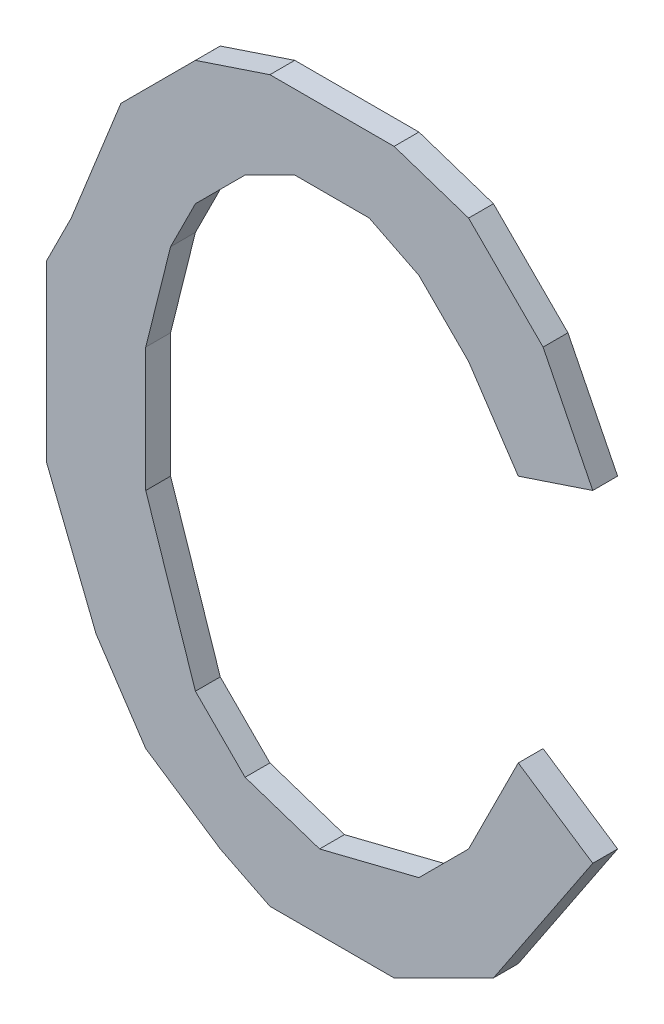
ISO-10303-21;
HEADER;
FILE_DESCRIPTION(('STEP AP214'),'2;1');
FILE_NAME('part.step','',(''),(''),'','','');
FILE_SCHEMA(('AUTOMOTIVE_DESIGN { 1 0 10303 214 1 1 1 1 }'));
ENDSEC;
DATA;
#1=APPLICATION_CONTEXT('core data for automotive mechanical design processes');
#2=APPLICATION_PROTOCOL_DEFINITION('international standard','automotive_design',2000,#1);
#3=PRODUCT_CONTEXT('',#1,'mechanical');
#4=PRODUCT('Part','Part','',(#3));
#5=PRODUCT_RELATED_PRODUCT_CATEGORY('part','',(#4));
#6=PRODUCT_DEFINITION_FORMATION('','',#4);
#7=PRODUCT_DEFINITION_CONTEXT('part definition',#1,'design');
#8=PRODUCT_DEFINITION('design','',#6,#7);
#9=PRODUCT_DEFINITION_SHAPE('','',#8);
#10=(LENGTH_UNIT() NAMED_UNIT(*) SI_UNIT(.MILLI.,.METRE.));
#11=(NAMED_UNIT(*) PLANE_ANGLE_UNIT() SI_UNIT($,.RADIAN.));
#12=(NAMED_UNIT(*) SI_UNIT($,.STERADIAN.) SOLID_ANGLE_UNIT());
#13=UNCERTAINTY_MEASURE_WITH_UNIT(LENGTH_MEASURE(1.E-05),#10,'distance_accuracy_value','');
#14=(GEOMETRIC_REPRESENTATION_CONTEXT(3) GLOBAL_UNCERTAINTY_ASSIGNED_CONTEXT((#13)) GLOBAL_UNIT_ASSIGNED_CONTEXT((#10,
#11,#12)) REPRESENTATION_CONTEXT('',''));
#15=CARTESIAN_POINT('',(0.,0.,0.));
#16=DIRECTION('',(0.,0.,1.));
#17=DIRECTION('',(1.,0.,0.));
#18=AXIS2_PLACEMENT_3D('',#15,#16,#17);
#19=CARTESIAN_POINT('',(-0.06999732,0.02500122000001,0.));
#20=DIRECTION('',(0.,0.,1.));
#21=DIRECTION('',(1.,0.,0.));
#22=AXIS2_PLACEMENT_3D('',#19,#20,#21);
#23=PLANE('',#22);
#24=DIRECTION('',(0.316227766016838,-0.948683298050514,0.));
#25=VECTOR('',#24,1.);
#26=CARTESIAN_POINT('',(-0.04999736000001,-0.08499855999999,0.));
#27=LINE('',#26,#25);
#28=CARTESIAN_POINT('',(-0.069997320000003,-0.024998680000001,0.));
#29=VERTEX_POINT('',#28);
#30=CARTESIAN_POINT('',(-0.04999736000001,-0.08499855999999,0.));
#31=VERTEX_POINT('',#30);
#32=EDGE_CURVE('E395',#29,#31,#27,.T.);
#33=ORIENTED_EDGE('',*,*,#32,.T.);
#34=DIRECTION('',(0.707106781186548,-0.707106781186548,0.));
#35=VECTOR('',#34,1.);
#36=CARTESIAN_POINT('',(-0.0299974,-0.10499852,0.));
#37=LINE('',#36,#35);
#38=CARTESIAN_POINT('',(-0.0299973999999986,-0.104998519999996,0.));
#39=VERTEX_POINT('',#38);
#40=EDGE_CURVE('E390',#31,#39,#37,.T.);
#41=ORIENTED_EDGE('',*,*,#40,.T.);
#42=DIRECTION('',(0.948683298050414,-0.316227766017138,0.));
#43=VECTOR('',#42,1.);
#44=CARTESIAN_POINT('',(2.539999996998E-06,-0.1149985,0.));
#45=LINE('',#44,#43);
#46=CARTESIAN_POINT('',(2.53999999587647E-06,-0.114998499999996,0.));
#47=VERTEX_POINT('',#46);
#48=EDGE_CURVE('E385',#39,#47,#45,.T.);
#49=ORIENTED_EDGE('',*,*,#48,.T.);
#50=DIRECTION('',(0.970142500145391,0.242535625036098,0.));
#51=VECTOR('',#50,1.);
#52=CARTESIAN_POINT('',(0.04000246,-0.10499852,0.));
#53=LINE('',#52,#51);
#54=CARTESIAN_POINT('',(0.0400024600000021,-0.104998520000002,0.));
#55=VERTEX_POINT('',#54);
#56=EDGE_CURVE('E380',#47,#55,#53,.T.);
#57=ORIENTED_EDGE('',*,*,#56,.T.);
#58=DIRECTION('',(0.707106781186048,0.707106781187048,0.));
#59=VECTOR('',#58,1.);
#60=CARTESIAN_POINT('',(0.06000241999999,-0.08499855999999,0.));
#61=LINE('',#60,#59);
#62=CARTESIAN_POINT('',(0.060002419999994,-0.084998559999992,0.));
#63=VERTEX_POINT('',#62);
#64=EDGE_CURVE('E375',#55,#63,#61,.T.);
#65=ORIENTED_EDGE('',*,*,#64,.T.);
#66=DIRECTION('',(0.447213595499958,0.894427190999916,0.));
#67=VECTOR('',#66,1.);
#68=CARTESIAN_POINT('',(0.08000238,-0.04499863999999,0.));
#69=LINE('',#68,#67);
#70=CARTESIAN_POINT('',(0.0800023799999949,-0.0449986399999976,0.));
#71=VERTEX_POINT('',#70);
#72=EDGE_CURVE('E370',#63,#71,#69,.T.);
#73=ORIENTED_EDGE('',*,*,#72,.T.);
#74=DIRECTION('',(0.832050294337997,-0.554700196224998,0.));
#75=VECTOR('',#74,1.);
#76=CARTESIAN_POINT('',(0.11000232,-0.0649986,0.));
#77=LINE('',#76,#75);
#78=CARTESIAN_POINT('',(0.110002319999988,-0.0649985999999921,0.));
#79=VERTEX_POINT('',#78);
#80=EDGE_CURVE('E365',#71,#79,#77,.T.);
#81=ORIENTED_EDGE('',*,*,#80,.T.);
#82=DIRECTION('',(-0.554700196224998,-0.832050294337997,0.));
#83=VECTOR('',#82,1.);
#84=CARTESIAN_POINT('',(0.07000239999999,-0.12499848,0.));
#85=LINE('',#84,#83);
#86=CARTESIAN_POINT('',(0.07000239999999,-0.12499848,0.));
#87=VERTEX_POINT('',#86);
#88=EDGE_CURVE('E360',#79,#87,#85,.T.);
#89=ORIENTED_EDGE('',*,*,#88,.T.);
#90=DIRECTION('',(-0.894427190999916,-0.447213595499958,0.));
#91=VECTOR('',#90,1.);
#92=CARTESIAN_POINT('',(0.03000247999999,-0.14499844,0.));
#93=LINE('',#92,#91);
#94=CARTESIAN_POINT('',(0.03000247999999,-0.14499844,0.));
#95=VERTEX_POINT('',#94);
#96=EDGE_CURVE('E355',#87,#95,#93,.T.);
#97=ORIENTED_EDGE('',*,*,#96,.T.);
#98=DIRECTION('',(1.,0.,0.));
#99=VECTOR('',#98,1.);
#100=CARTESIAN_POINT('',(-0.01999742000001,-0.14499844,0.));
#101=LINE('',#100,#99);
#102=CARTESIAN_POINT('',(-0.019997420000009,-0.144998439999998,0.));
#103=VERTEX_POINT('',#102);
#104=EDGE_CURVE('E350',#95,#103,#101,.F.);
#105=ORIENTED_EDGE('',*,*,#104,.T.);
#106=DIRECTION('',(-0.894427190999916,0.447213595499958,0.));
#107=VECTOR('',#106,1.);
#108=CARTESIAN_POINT('',(-0.03999738,-0.13499846,0.));
#109=LINE('',#108,#107);
#110=CARTESIAN_POINT('',(-0.0399973799999972,-0.134998459999996,0.));
#111=VERTEX_POINT('',#110);
#112=EDGE_CURVE('E345',#103,#111,#109,.T.);
#113=ORIENTED_EDGE('',*,*,#112,.T.);
#114=DIRECTION('',(-0.832050294337997,0.554700196224998,0.));
#115=VECTOR('',#114,1.);
#116=CARTESIAN_POINT('',(-0.06999732,-0.1149985,0.));
#117=LINE('',#116,#115);
#118=CARTESIAN_POINT('',(-0.0699973200000011,-0.114998500000001,0.));
#119=VERTEX_POINT('',#118);
#120=EDGE_CURVE('E340',#111,#119,#117,.T.);
#121=ORIENTED_EDGE('',*,*,#120,.T.);
#122=DIRECTION('',(-0.554748964411929,0.832017780148893,0.));
#123=VECTOR('',#122,1.);
#124=CARTESIAN_POINT('',(-0.08999982,-0.08499855999999,0.));
#125=LINE('',#124,#123);
#126=CARTESIAN_POINT('',(-0.0899998200000017,-0.0849985599999907,0.));
#127=VERTEX_POINT('',#126);
#128=EDGE_CURVE('E335',#119,#127,#125,.T.);
#129=ORIENTED_EDGE('',*,*,#128,.T.);
#130=DIRECTION('',(-0.371390676354104,0.928476690885259,0.));
#131=VECTOR('',#130,1.);
#132=CARTESIAN_POINT('',(-0.10999978,-0.03499866,0.));
#133=LINE('',#132,#131);
#134=CARTESIAN_POINT('',(-0.10999978,-0.03499866,0.));
#135=VERTEX_POINT('',#134);
#136=EDGE_CURVE('E330',#127,#135,#133,.T.);
#137=ORIENTED_EDGE('',*,*,#136,.T.);
#138=DIRECTION('',(0.,1.,0.));
#139=VECTOR('',#138,1.);
#140=CARTESIAN_POINT('',(-0.10999978,0.03500120000001,0.));
#141=LINE('',#140,#139);
#142=CARTESIAN_POINT('',(-0.109999780000002,0.035001200000011,0.));
#143=VERTEX_POINT('',#142);
#144=EDGE_CURVE('E325',#135,#143,#141,.T.);
#145=ORIENTED_EDGE('',*,*,#144,.T.);
#146=DIRECTION('',(0.447213595499958,0.894427190999916,0.));
#147=VECTOR('',#146,1.);
#148=CARTESIAN_POINT('',(-0.09999980000001,0.05500116,0.));
#149=LINE('',#148,#147);
#150=CARTESIAN_POINT('',(-0.0999998000000056,0.0550011599999985,0.));
#151=VERTEX_POINT('',#150);
#152=EDGE_CURVE('E320',#143,#151,#149,.T.);
#153=ORIENTED_EDGE('',*,*,#152,.T.);
#154=DIRECTION('',(0.371390676354104,0.928476690885259,0.));
#155=VECTOR('',#154,1.);
#156=CARTESIAN_POINT('',(-0.07999984,0.10500106,0.));
#157=LINE('',#156,#155);
#158=CARTESIAN_POINT('',(-0.0799998400000079,0.105001060000008,0.));
#159=VERTEX_POINT('',#158);
#160=EDGE_CURVE('E315',#151,#159,#157,.T.);
#161=ORIENTED_EDGE('',*,*,#160,.T.);
#162=DIRECTION('',(0.707136713532992,0.707076847572992,0.));
#163=VECTOR('',#162,1.);
#164=CARTESIAN_POINT('',(-0.04999736000001,0.135001,0.));
#165=LINE('',#164,#163);
#166=CARTESIAN_POINT('',(-0.0499973600000084,0.135000999999995,0.));
#167=VERTEX_POINT('',#166);
#168=EDGE_CURVE('E310',#159,#167,#165,.T.);
#169=ORIENTED_EDGE('',*,*,#168,.T.);
#170=DIRECTION('',(0.948683298050414,0.316227766017138,0.));
#171=VECTOR('',#170,1.);
#172=CARTESIAN_POINT('',(-0.01999742000001,0.14500098,0.));
#173=LINE('',#172,#171);
#174=CARTESIAN_POINT('',(-0.01999742000001,0.14500098,0.));
#175=VERTEX_POINT('',#174);
#176=EDGE_CURVE('E305',#167,#175,#173,.T.);
#177=ORIENTED_EDGE('',*,*,#176,.T.);
#178=DIRECTION('',(1.,0.,0.));
#179=VECTOR('',#178,1.);
#180=CARTESIAN_POINT('',(0.03000247999999,0.14500098,0.));
#181=LINE('',#180,#179);
#182=CARTESIAN_POINT('',(0.0300024799999916,0.145000980000005,0.));
#183=VERTEX_POINT('',#182);
#184=EDGE_CURVE('E300',#175,#183,#181,.T.);
#185=ORIENTED_EDGE('',*,*,#184,.T.);
#186=DIRECTION('',(0.948683298050414,-0.316227766017138,0.));
#187=VECTOR('',#186,1.);
#188=CARTESIAN_POINT('',(0.06000241999999,0.135001,0.));
#189=LINE('',#188,#187);
#190=CARTESIAN_POINT('',(0.0600024199999819,0.135000999999992,0.));
#191=VERTEX_POINT('',#190);
#192=EDGE_CURVE('E295',#183,#191,#189,.T.);
#193=ORIENTED_EDGE('',*,*,#192,.T.);
#194=DIRECTION('',(0.707106781187048,-0.707106781186048,0.));
#195=VECTOR('',#194,1.);
#196=CARTESIAN_POINT('',(0.09000236,0.10500106,0.));
#197=LINE('',#196,#195);
#198=CARTESIAN_POINT('',(0.090002360000002,0.105001060000001,0.));
#199=VERTEX_POINT('',#198);
#200=EDGE_CURVE('E290',#191,#199,#197,.T.);
#201=ORIENTED_EDGE('',*,*,#200,.T.);
#202=DIRECTION('',(0.447213595499958,-0.894427190999916,0.));
#203=VECTOR('',#202,1.);
#204=CARTESIAN_POINT('',(0.11000232,0.06500114000001,0.));
#205=LINE('',#204,#203);
#206=CARTESIAN_POINT('',(0.11000232,0.0650011400000103,0.));
#207=VERTEX_POINT('',#206);
#208=EDGE_CURVE('E285',#199,#207,#205,.T.);
#209=ORIENTED_EDGE('',*,*,#208,.T.);
#210=DIRECTION('',(-0.948683298050414,-0.316227766017138,0.));
#211=VECTOR('',#210,1.);
#212=CARTESIAN_POINT('',(0.08000238,0.05500116,0.));
#213=LINE('',#212,#211);
#214=CARTESIAN_POINT('',(0.0800023799999924,0.0550011599999949,0.));
#215=VERTEX_POINT('',#214);
#216=EDGE_CURVE('E280',#207,#215,#213,.T.);
#217=ORIENTED_EDGE('',*,*,#216,.T.);
#218=DIRECTION('',(-0.554700196224998,0.832050294337997,0.));
#219=VECTOR('',#218,1.);
#220=CARTESIAN_POINT('',(0.06000241999999,0.0850011,0.));
#221=LINE('',#220,#219);
#222=CARTESIAN_POINT('',(0.0600024199999854,0.0850010999999955,0.));
#223=VERTEX_POINT('',#222);
#224=EDGE_CURVE('E275',#215,#223,#221,.T.);
#225=ORIENTED_EDGE('',*,*,#224,.T.);
#226=DIRECTION('',(-0.707106781186048,0.707106781187048,0.));
#227=VECTOR('',#226,1.);
#228=CARTESIAN_POINT('',(0.04000246,0.10500106,0.));
#229=LINE('',#228,#227);
#230=CARTESIAN_POINT('',(0.040002459999999,0.105001059999998,0.));
#231=VERTEX_POINT('',#230);
#232=EDGE_CURVE('E270',#223,#231,#229,.T.);
#233=ORIENTED_EDGE('',*,*,#232,.T.);
#234=DIRECTION('',(-0.894427190999916,0.447213595499958,0.));
#235=VECTOR('',#234,1.);
#236=CARTESIAN_POINT('',(0.02000249999999,0.11500104,0.));
#237=LINE('',#236,#235);
#238=CARTESIAN_POINT('',(0.02000249999999,0.11500104,0.));
#239=VERTEX_POINT('',#238);
#240=EDGE_CURVE('E265',#231,#239,#237,.T.);
#241=ORIENTED_EDGE('',*,*,#240,.T.);
#242=DIRECTION('',(1.,0.,0.));
#243=VECTOR('',#242,1.);
#244=CARTESIAN_POINT('',(-0.009997440000006,0.11500104,0.));
#245=LINE('',#244,#243);
#246=CARTESIAN_POINT('',(-0.0099974400000054,0.115001039999999,0.));
#247=VERTEX_POINT('',#246);
#248=EDGE_CURVE('E260',#239,#247,#245,.F.);
#249=ORIENTED_EDGE('',*,*,#248,.T.);
#250=DIRECTION('',(-0.894427190999916,-0.447213595499958,0.));
#251=VECTOR('',#250,1.);
#252=CARTESIAN_POINT('',(-0.0299974,0.10500106,0.));
#253=LINE('',#252,#251);
#254=CARTESIAN_POINT('',(-0.0299974000000025,0.105001060000002,0.));
#255=VERTEX_POINT('',#254);
#256=EDGE_CURVE('E256',#247,#255,#253,.T.);
#257=ORIENTED_EDGE('',*,*,#256,.T.);
#258=DIRECTION('',(-0.707106781186548,-0.707106781186548,0.));
#259=VECTOR('',#258,1.);
#260=CARTESIAN_POINT('',(-0.04999736000001,0.0850011,0.));
#261=LINE('',#260,#259);
#262=CARTESIAN_POINT('',(-0.049997360000012,0.085001100000001,0.));
#263=VERTEX_POINT('',#262);
#264=EDGE_CURVE('E243',#255,#263,#261,.T.);
#265=ORIENTED_EDGE('',*,*,#264,.T.);
#266=DIRECTION('',(-0.447213595499958,-0.894427190999916,0.));
#267=VECTOR('',#266,1.);
#268=CARTESIAN_POINT('',(-0.05999734000001,0.06500114000001,0.));
#269=LINE('',#268,#267);
#270=CARTESIAN_POINT('',(-0.0599973400000101,0.0650011400000101,0.));
#271=VERTEX_POINT('',#270);
#272=EDGE_CURVE('E228',#263,#271,#269,.T.);
#273=ORIENTED_EDGE('',*,*,#272,.T.);
#274=DIRECTION('',(-0.242535625036098,-0.970142500145391,0.));
#275=VECTOR('',#274,1.);
#276=CARTESIAN_POINT('',(-0.06999732,0.02500122000001,0.));
#277=LINE('',#276,#275);
#278=CARTESIAN_POINT('',(-0.06999732,0.02500122000001,0.));
#279=VERTEX_POINT('',#278);
#280=EDGE_CURVE('E19',#271,#279,#277,.T.);
#281=ORIENTED_EDGE('',*,*,#280,.T.);
#282=DIRECTION('',(0.,1.,0.));
#283=VECTOR('',#282,1.);
#284=CARTESIAN_POINT('',(-0.06999732,-0.02499868,0.));
#285=LINE('',#284,#283);
#286=EDGE_CURVE('E399',#279,#29,#285,.F.);
#287=ORIENTED_EDGE('',*,*,#286,.T.);
#288=EDGE_LOOP('',(#33,#41,#49,#57,#65,#73,#81,#89,#97,#105,#113,#121,#129,#137,#145,#153,#161,
#169,#177,#185,#193,#201,#209,#217,#225,#233,#241,#249,#257,#265,#273,#281,#287));
#289=FACE_BOUND('',#288,.T.);
#290=ADVANCED_FACE('F16',(#289),#23,.F.);
#291=CARTESIAN_POINT('',(-0.06999732,0.02500122000001,0.));
#292=DIRECTION('',(-0.970142500145391,0.242535625036098,0.));
#293=DIRECTION('',(-0.242535625036098,-0.970142500145391,0.));
#294=AXIS2_PLACEMENT_3D('',#291,#292,#293);
#295=PLANE('',#294);
#296=DIRECTION('',(0.,0.,1.));
#297=VECTOR('',#296,1.);
#298=CARTESIAN_POINT('',(-0.05999734000001,0.06500114000001,0.));
#299=LINE('',#298,#297);
#300=CARTESIAN_POINT('',(-0.0599973400000101,0.0650011400000101,0.01));
#301=VERTEX_POINT('',#300);
#302=EDGE_CURVE('E234',#271,#301,#299,.T.);
#303=ORIENTED_EDGE('',*,*,#302,.T.);
#304=DIRECTION('',(0.242535625036105,0.970142500145389,0.));
#305=VECTOR('',#304,1.);
#306=CARTESIAN_POINT('',(-0.06999732,0.02500122000001,0.01));
#307=LINE('',#306,#305);
#308=CARTESIAN_POINT('',(-0.06999732,0.02500122000001,0.01));
#309=VERTEX_POINT('',#308);
#310=EDGE_CURVE('E401',#309,#301,#307,.T.);
#311=ORIENTED_EDGE('',*,*,#310,.F.);
#312=DIRECTION('',(0.,0.,1.));
#313=VECTOR('',#312,1.);
#314=CARTESIAN_POINT('',(-0.06999732,0.02500122000001,0.));
#315=LINE('',#314,#313);
#316=EDGE_CURVE('E237',#309,#279,#315,.F.);
#317=ORIENTED_EDGE('',*,*,#316,.T.);
#318=ORIENTED_EDGE('',*,*,#280,.F.);
#319=EDGE_LOOP('',(#303,#311,#317,#318));
#320=FACE_BOUND('',#319,.T.);
#321=ADVANCED_FACE('F233',(#320),#295,.F.);
#322=CARTESIAN_POINT('',(-0.05999734000001,0.06500114000001,0.));
#323=DIRECTION('',(-0.894427190999916,0.447213595499958,0.));
#324=DIRECTION('',(-0.447213595499958,-0.894427190999916,0.));
#325=AXIS2_PLACEMENT_3D('',#322,#323,#324);
#326=PLANE('',#325);
#327=DIRECTION('',(0.,0.,1.));
#328=VECTOR('',#327,1.);
#329=CARTESIAN_POINT('',(-0.04999736000001,0.0850011,0.));
#330=LINE('',#329,#328);
#331=CARTESIAN_POINT('',(-0.049997360000012,0.085001100000001,0.01));
#332=VERTEX_POINT('',#331);
#333=EDGE_CURVE('E245',#263,#332,#330,.T.);
#334=ORIENTED_EDGE('',*,*,#333,.T.);
#335=DIRECTION('',(0.447213595500137,0.894427190999826,0.));
#336=VECTOR('',#335,1.);
#337=CARTESIAN_POINT('',(-0.05999734000001,0.06500114000001,0.01));
#338=LINE('',#337,#336);
#339=EDGE_CURVE('E249',#301,#332,#338,.T.);
#340=ORIENTED_EDGE('',*,*,#339,.F.);
#341=ORIENTED_EDGE('',*,*,#302,.F.);
#342=ORIENTED_EDGE('',*,*,#272,.F.);
#343=EDGE_LOOP('',(#334,#340,#341,#342));
#344=FACE_BOUND('',#343,.T.);
#345=ADVANCED_FACE('F247',(#344),#326,.F.);
#346=CARTESIAN_POINT('',(-0.04999736000001,0.0850011,0.));
#347=DIRECTION('',(-0.707106781186548,0.707106781186548,0.));
#348=DIRECTION('',(-0.707106781186548,-0.707106781186548,0.));
#349=AXIS2_PLACEMENT_3D('',#346,#347,#348);
#350=PLANE('',#349);
#351=DIRECTION('',(0.,0.,1.));
#352=VECTOR('',#351,1.);
#353=CARTESIAN_POINT('',(-0.0299974,0.10500106,0.));
#354=LINE('',#353,#352);
#355=CARTESIAN_POINT('',(-0.0299974000000025,0.105001060000002,0.01));
#356=VERTEX_POINT('',#355);
#357=EDGE_CURVE('E254',#255,#356,#354,.T.);
#358=ORIENTED_EDGE('',*,*,#357,.T.);
#359=DIRECTION('',(0.707106781186724,0.707106781186371,0.));
#360=VECTOR('',#359,1.);
#361=CARTESIAN_POINT('',(-0.04999736000001,0.0850011,0.01));
#362=LINE('',#361,#360);
#363=EDGE_CURVE('E404',#332,#356,#362,.T.);
#364=ORIENTED_EDGE('',*,*,#363,.F.);
#365=ORIENTED_EDGE('',*,*,#333,.F.);
#366=ORIENTED_EDGE('',*,*,#264,.F.);
#367=EDGE_LOOP('',(#358,#364,#365,#366));
#368=FACE_BOUND('',#367,.T.);
#369=ADVANCED_FACE('F621',(#368),#350,.F.);
#370=CARTESIAN_POINT('',(-0.0299974,0.10500106,0.));
#371=DIRECTION('',(-0.447213595499958,0.894427190999916,0.));
#372=DIRECTION('',(-0.894427190999916,-0.447213595499958,0.));
#373=AXIS2_PLACEMENT_3D('',#370,#371,#372);
#374=PLANE('',#373);
#375=DIRECTION('',(0.,0.,1.));
#376=VECTOR('',#375,1.);
#377=CARTESIAN_POINT('',(-0.009997440000006,0.11500104,0.));
#378=LINE('',#377,#376);
#379=CARTESIAN_POINT('',(-0.00999744000000541,0.115001039999999,0.01));
#380=VERTEX_POINT('',#379);
#381=EDGE_CURVE('E258',#247,#380,#378,.T.);
#382=ORIENTED_EDGE('',*,*,#381,.T.);
#383=DIRECTION('',(0.894427190999862,0.447213595500065,0.));
#384=VECTOR('',#383,1.);
#385=CARTESIAN_POINT('',(-0.0299974,0.10500106,0.01));
#386=LINE('',#385,#384);
#387=EDGE_CURVE('E407',#356,#380,#386,.T.);
#388=ORIENTED_EDGE('',*,*,#387,.F.);
#389=ORIENTED_EDGE('',*,*,#357,.F.);
#390=ORIENTED_EDGE('',*,*,#256,.F.);
#391=EDGE_LOOP('',(#382,#388,#389,#390));
#392=FACE_BOUND('',#391,.T.);
#393=ADVANCED_FACE('F617',(#392),#374,.F.);
#394=CARTESIAN_POINT('',(-0.009997440000006,0.11500104,0.));
#395=DIRECTION('',(0.,1.,0.));
#396=DIRECTION('',(0.,0.,1.));
#397=AXIS2_PLACEMENT_3D('',#394,#395,#396);
#398=PLANE('',#397);
#399=DIRECTION('',(0.,0.,1.));
#400=VECTOR('',#399,1.);
#401=CARTESIAN_POINT('',(0.02000249999999,0.11500104,0.));
#402=LINE('',#401,#400);
#403=CARTESIAN_POINT('',(0.02000249999999,0.11500104,0.01));
#404=VERTEX_POINT('',#403);
#405=EDGE_CURVE('E263',#239,#404,#402,.T.);
#406=ORIENTED_EDGE('',*,*,#405,.T.);
#407=DIRECTION('',(1.,0.,0.));
#408=VECTOR('',#407,1.);
#409=CARTESIAN_POINT('',(-0.06999732,0.11500104,0.01));
#410=LINE('',#409,#408);
#411=EDGE_CURVE('E410',#380,#404,#410,.T.);
#412=ORIENTED_EDGE('',*,*,#411,.F.);
#413=ORIENTED_EDGE('',*,*,#381,.F.);
#414=ORIENTED_EDGE('',*,*,#248,.F.);
#415=EDGE_LOOP('',(#406,#412,#413,#414));
#416=FACE_BOUND('',#415,.T.);
#417=ADVANCED_FACE('F613',(#416),#398,.F.);
#418=CARTESIAN_POINT('',(0.02000249999999,0.11500104,0.));
#419=DIRECTION('',(0.447213595499958,0.894427190999916,0.));
#420=DIRECTION('',(-0.894427190999916,0.447213595499958,0.));
#421=AXIS2_PLACEMENT_3D('',#418,#419,#420);
#422=PLANE('',#421);
#423=DIRECTION('',(0.,0.,1.));
#424=VECTOR('',#423,1.);
#425=CARTESIAN_POINT('',(0.04000246,0.10500106,0.));
#426=LINE('',#425,#424);
#427=CARTESIAN_POINT('',(0.040002459999999,0.105001059999998,0.01));
#428=VERTEX_POINT('',#427);
#429=EDGE_CURVE('E268',#231,#428,#426,.T.);
#430=ORIENTED_EDGE('',*,*,#429,.T.);
#431=DIRECTION('',(0.894427191000005,-0.447213595499779,0.));
#432=VECTOR('',#431,1.);
#433=CARTESIAN_POINT('',(0.02000249999999,0.11500104,0.01));
#434=LINE('',#433,#432);
#435=EDGE_CURVE('E413',#404,#428,#434,.T.);
#436=ORIENTED_EDGE('',*,*,#435,.F.);
#437=ORIENTED_EDGE('',*,*,#405,.F.);
#438=ORIENTED_EDGE('',*,*,#240,.F.);
#439=EDGE_LOOP('',(#430,#436,#437,#438));
#440=FACE_BOUND('',#439,.T.);
#441=ADVANCED_FACE('F609',(#440),#422,.F.);
#442=CARTESIAN_POINT('',(0.04000246,0.10500106,0.));
#443=DIRECTION('',(0.707106781187048,0.707106781186048,0.));
#444=DIRECTION('',(-0.707106781186048,0.707106781187048,0.));
#445=AXIS2_PLACEMENT_3D('',#442,#443,#444);
#446=PLANE('',#445);
#447=DIRECTION('',(0.,0.,1.));
#448=VECTOR('',#447,1.);
#449=CARTESIAN_POINT('',(0.06000241999999,0.0850011,0.));
#450=LINE('',#449,#448);
#451=CARTESIAN_POINT('',(0.0600024199999854,0.0850010999999955,0.01));
#452=VERTEX_POINT('',#451);
#453=EDGE_CURVE('E273',#223,#452,#450,.T.);
#454=ORIENTED_EDGE('',*,*,#453,.T.);
#455=DIRECTION('',(0.707106781186371,-0.707106781186724,0.));
#456=VECTOR('',#455,1.);
#457=CARTESIAN_POINT('',(0.04000246,0.10500106,0.01));
#458=LINE('',#457,#456);
#459=EDGE_CURVE('E416',#428,#452,#458,.T.);
#460=ORIENTED_EDGE('',*,*,#459,.F.);
#461=ORIENTED_EDGE('',*,*,#429,.F.);
#462=ORIENTED_EDGE('',*,*,#232,.F.);
#463=EDGE_LOOP('',(#454,#460,#461,#462));
#464=FACE_BOUND('',#463,.T.);
#465=ADVANCED_FACE('F605',(#464),#446,.F.);
#466=CARTESIAN_POINT('',(0.06000241999999,0.0850011,0.));
#467=DIRECTION('',(0.832050294337997,0.554700196224998,0.));
#468=DIRECTION('',(-0.554700196224998,0.832050294337997,0.));
#469=AXIS2_PLACEMENT_3D('',#466,#467,#468);
#470=PLANE('',#469);
#471=DIRECTION('',(0.,0.,1.));
#472=VECTOR('',#471,1.);
#473=CARTESIAN_POINT('',(0.08000238,0.05500116,0.));
#474=LINE('',#473,#472);
#475=CARTESIAN_POINT('',(0.0800023799999924,0.0550011599999949,0.01));
#476=VERTEX_POINT('',#475);
#477=EDGE_CURVE('E278',#215,#476,#474,.T.);
#478=ORIENTED_EDGE('',*,*,#477,.T.);
#479=DIRECTION('',(0.554700196225421,-0.832050294337716,0.));
#480=VECTOR('',#479,1.);
#481=CARTESIAN_POINT('',(0.06000241999999,0.0850011,0.01));
#482=LINE('',#481,#480);
#483=EDGE_CURVE('E419',#452,#476,#482,.T.);
#484=ORIENTED_EDGE('',*,*,#483,.F.);
#485=ORIENTED_EDGE('',*,*,#453,.F.);
#486=ORIENTED_EDGE('',*,*,#224,.F.);
#487=EDGE_LOOP('',(#478,#484,#485,#486));
#488=FACE_BOUND('',#487,.T.);
#489=ADVANCED_FACE('F601',(#488),#470,.F.);
#490=CARTESIAN_POINT('',(0.08000238,0.05500116,0.));
#491=DIRECTION('',(-0.316227766017138,0.948683298050414,0.));
#492=DIRECTION('',(-0.948683298050414,-0.316227766017138,0.));
#493=AXIS2_PLACEMENT_3D('',#490,#491,#492);
#494=PLANE('',#493);
#495=DIRECTION('',(0.,0.,1.));
#496=VECTOR('',#495,1.);
#497=CARTESIAN_POINT('',(0.11000232,0.06500114000001,0.));
#498=LINE('',#497,#496);
#499=CARTESIAN_POINT('',(0.11000232,0.0650011400000103,0.01));
#500=VERTEX_POINT('',#499);
#501=EDGE_CURVE('E283',#207,#500,#498,.T.);
#502=ORIENTED_EDGE('',*,*,#501,.T.);
#503=DIRECTION('',(0.948683298050419,0.316227766017123,0.));
#504=VECTOR('',#503,1.);
#505=CARTESIAN_POINT('',(0.08000238,0.05500116,0.01));
#506=LINE('',#505,#504);
#507=EDGE_CURVE('E422',#476,#500,#506,.T.);
#508=ORIENTED_EDGE('',*,*,#507,.F.);
#509=ORIENTED_EDGE('',*,*,#477,.F.);
#510=ORIENTED_EDGE('',*,*,#216,.F.);
#511=EDGE_LOOP('',(#502,#508,#509,#510));
#512=FACE_BOUND('',#511,.T.);
#513=ADVANCED_FACE('F597',(#512),#494,.F.);
#514=CARTESIAN_POINT('',(0.11000232,0.06500114000001,0.));
#515=DIRECTION('',(-0.894427190999916,-0.447213595499958,0.));
#516=DIRECTION('',(0.447213595499958,-0.894427190999916,0.));
#517=AXIS2_PLACEMENT_3D('',#514,#515,#516);
#518=PLANE('',#517);
#519=DIRECTION('',(0.,0.,1.));
#520=VECTOR('',#519,1.);
#521=CARTESIAN_POINT('',(0.09000236,0.10500106,0.));
#522=LINE('',#521,#520);
#523=CARTESIAN_POINT('',(0.090002360000002,0.105001060000001,0.01));
#524=VERTEX_POINT('',#523);
#525=EDGE_CURVE('E288',#199,#524,#522,.T.);
#526=ORIENTED_EDGE('',*,*,#525,.T.);
#527=DIRECTION('',(-0.447213595500047,0.894427190999871,0.));
#528=VECTOR('',#527,1.);
#529=CARTESIAN_POINT('',(0.11000232,0.06500114000001,0.01));
#530=LINE('',#529,#528);
#531=EDGE_CURVE('E425',#500,#524,#530,.T.);
#532=ORIENTED_EDGE('',*,*,#531,.F.);
#533=ORIENTED_EDGE('',*,*,#501,.F.);
#534=ORIENTED_EDGE('',*,*,#208,.F.);
#535=EDGE_LOOP('',(#526,#532,#533,#534));
#536=FACE_BOUND('',#535,.T.);
#537=ADVANCED_FACE('F593',(#536),#518,.F.);
#538=CARTESIAN_POINT('',(0.09000236,0.10500106,0.));
#539=DIRECTION('',(-0.707106781186048,-0.707106781187048,0.));
#540=DIRECTION('',(0.707106781187048,-0.707106781186048,0.));
#541=AXIS2_PLACEMENT_3D('',#538,#539,#540);
#542=PLANE('',#541);
#543=DIRECTION('',(0.,0.,1.));
#544=VECTOR('',#543,1.);
#545=CARTESIAN_POINT('',(0.06000241999999,0.135001,0.));
#546=LINE('',#545,#544);
#547=CARTESIAN_POINT('',(0.0600024199999819,0.135000999999992,0.01));
#548=VERTEX_POINT('',#547);
#549=EDGE_CURVE('E293',#191,#548,#546,.T.);
#550=ORIENTED_EDGE('',*,*,#549,.T.);
#551=DIRECTION('',(-0.707106781186665,0.70710678118643,0.));
#552=VECTOR('',#551,1.);
#553=CARTESIAN_POINT('',(0.09000236,0.10500106,0.01));
#554=LINE('',#553,#552);
#555=EDGE_CURVE('E428',#524,#548,#554,.T.);
#556=ORIENTED_EDGE('',*,*,#555,.F.);
#557=ORIENTED_EDGE('',*,*,#525,.F.);
#558=ORIENTED_EDGE('',*,*,#200,.F.);
#559=EDGE_LOOP('',(#550,#556,#557,#558));
#560=FACE_BOUND('',#559,.T.);
#561=ADVANCED_FACE('F589',(#560),#542,.F.);
#562=CARTESIAN_POINT('',(0.06000241999999,0.135001,0.));
#563=DIRECTION('',(-0.316227766017138,-0.948683298050414,0.));
#564=DIRECTION('',(0.948683298050414,-0.316227766017138,0.));
#565=AXIS2_PLACEMENT_3D('',#562,#563,#564);
#566=PLANE('',#565);
#567=DIRECTION('',(0.,0.,-1.));
#568=VECTOR('',#567,1.);
#569=CARTESIAN_POINT('',(0.03000247999999,0.14500098,0.));
#570=LINE('',#569,#568);
#571=CARTESIAN_POINT('',(0.0300024799999916,0.145000980000005,0.01));
#572=VERTEX_POINT('',#571);
#573=EDGE_CURVE('E298',#183,#572,#570,.F.);
#574=ORIENTED_EDGE('',*,*,#573,.T.);
#575=DIRECTION('',(-0.948683298050514,0.316227766016838,0.));
#576=VECTOR('',#575,1.);
#577=CARTESIAN_POINT('',(0.06000241999999,0.135001,0.01));
#578=LINE('',#577,#576);
#579=EDGE_CURVE('E431',#548,#572,#578,.T.);
#580=ORIENTED_EDGE('',*,*,#579,.F.);
#581=ORIENTED_EDGE('',*,*,#549,.F.);
#582=ORIENTED_EDGE('',*,*,#192,.F.);
#583=EDGE_LOOP('',(#574,#580,#581,#582));
#584=FACE_BOUND('',#583,.T.);
#585=ADVANCED_FACE('F585',(#584),#566,.F.);
#586=CARTESIAN_POINT('',(0.03000247999999,0.14500098,0.));
#587=DIRECTION('',(0.,-1.,0.));
#588=DIRECTION('',(0.,0.,-1.));
#589=AXIS2_PLACEMENT_3D('',#586,#587,#588);
#590=PLANE('',#589);
#591=DIRECTION('',(0.,0.,1.));
#592=VECTOR('',#591,1.);
#593=CARTESIAN_POINT('',(-0.01999742000001,0.14500098,0.));
#594=LINE('',#593,#592);
#595=CARTESIAN_POINT('',(-0.01999742000001,0.14500098,0.01));
#596=VERTEX_POINT('',#595);
#597=EDGE_CURVE('E303',#175,#596,#594,.T.);
#598=ORIENTED_EDGE('',*,*,#597,.T.);
#599=DIRECTION('',(1.,0.,0.));
#600=VECTOR('',#599,1.);
#601=CARTESIAN_POINT('',(-0.06999732,0.14500098,0.01));
#602=LINE('',#601,#600);
#603=EDGE_CURVE('E434',#572,#596,#602,.F.);
#604=ORIENTED_EDGE('',*,*,#603,.F.);
#605=ORIENTED_EDGE('',*,*,#573,.F.);
#606=ORIENTED_EDGE('',*,*,#184,.F.);
#607=EDGE_LOOP('',(#598,#604,#605,#606));
#608=FACE_BOUND('',#607,.T.);
#609=ADVANCED_FACE('F581',(#608),#590,.F.);
#610=CARTESIAN_POINT('',(-0.01999742000001,0.14500098,0.));
#611=DIRECTION('',(0.316227766017138,-0.948683298050414,0.));
#612=DIRECTION('',(0.948683298050414,0.316227766017138,0.));
#613=AXIS2_PLACEMENT_3D('',#610,#611,#612);
#614=PLANE('',#613);
#615=DIRECTION('',(0.,0.,1.));
#616=VECTOR('',#615,1.);
#617=CARTESIAN_POINT('',(-0.04999736000001,0.135001,0.));
#618=LINE('',#617,#616);
#619=CARTESIAN_POINT('',(-0.0499973600000084,0.135000999999995,0.01));
#620=VERTEX_POINT('',#619);
#621=EDGE_CURVE('E308',#167,#620,#618,.T.);
#622=ORIENTED_EDGE('',*,*,#621,.T.);
#623=DIRECTION('',(-0.948683298050514,-0.316227766016838,0.));
#624=VECTOR('',#623,1.);
#625=CARTESIAN_POINT('',(-0.01999742000001,0.14500098,0.01));
#626=LINE('',#625,#624);
#627=EDGE_CURVE('E437',#596,#620,#626,.T.);
#628=ORIENTED_EDGE('',*,*,#627,.F.);
#629=ORIENTED_EDGE('',*,*,#597,.F.);
#630=ORIENTED_EDGE('',*,*,#176,.F.);
#631=EDGE_LOOP('',(#622,#628,#629,#630));
#632=FACE_BOUND('',#631,.T.);
#633=ADVANCED_FACE('F577',(#632),#614,.F.);
#634=CARTESIAN_POINT('',(-0.04999736000001,0.135001,0.));
#635=DIRECTION('',(0.707076847572992,-0.707136713532992,0.));
#636=DIRECTION('',(0.707136713532992,0.707076847572992,0.));
#637=AXIS2_PLACEMENT_3D('',#634,#635,#636);
#638=PLANE('',#637);
#639=DIRECTION('',(0.,0.,1.));
#640=VECTOR('',#639,1.);
#641=CARTESIAN_POINT('',(-0.07999984,0.10500106,0.));
#642=LINE('',#641,#640);
#643=CARTESIAN_POINT('',(-0.0799998400000079,0.105001060000008,0.01));
#644=VERTEX_POINT('',#643);
#645=EDGE_CURVE('E313',#159,#644,#642,.T.);
#646=ORIENTED_EDGE('',*,*,#645,.T.);
#647=DIRECTION('',(-0.70713671353262,-0.707076847573363,0.));
#648=VECTOR('',#647,1.);
#649=CARTESIAN_POINT('',(-0.04999736000001,0.135001,0.01));
#650=LINE('',#649,#648);
#651=EDGE_CURVE('E440',#620,#644,#650,.T.);
#652=ORIENTED_EDGE('',*,*,#651,.F.);
#653=ORIENTED_EDGE('',*,*,#621,.F.);
#654=ORIENTED_EDGE('',*,*,#168,.F.);
#655=EDGE_LOOP('',(#646,#652,#653,#654));
#656=FACE_BOUND('',#655,.T.);
#657=ADVANCED_FACE('F573',(#656),#638,.F.);
#658=CARTESIAN_POINT('',(-0.07999984,0.10500106,0.));
#659=DIRECTION('',(0.928476690885259,-0.371390676354104,0.));
#660=DIRECTION('',(0.371390676354104,0.928476690885259,0.));
#661=AXIS2_PLACEMENT_3D('',#658,#659,#660);
#662=PLANE('',#661);
#663=DIRECTION('',(0.,0.,1.));
#664=VECTOR('',#663,1.);
#665=CARTESIAN_POINT('',(-0.09999980000001,0.05500116,0.));
#666=LINE('',#665,#664);
#667=CARTESIAN_POINT('',(-0.0999998000000056,0.0550011599999985,0.01));
#668=VERTEX_POINT('',#667);
#669=EDGE_CURVE('E318',#151,#668,#666,.T.);
#670=ORIENTED_EDGE('',*,*,#669,.T.);
#671=DIRECTION('',(-0.371390676354264,-0.928476690885195,0.));
#672=VECTOR('',#671,1.);
#673=CARTESIAN_POINT('',(-0.07999984,0.10500106,0.01));
#674=LINE('',#673,#672);
#675=EDGE_CURVE('E443',#644,#668,#674,.T.);
#676=ORIENTED_EDGE('',*,*,#675,.F.);
#677=ORIENTED_EDGE('',*,*,#645,.F.);
#678=ORIENTED_EDGE('',*,*,#160,.F.);
#679=EDGE_LOOP('',(#670,#676,#677,#678));
#680=FACE_BOUND('',#679,.T.);
#681=ADVANCED_FACE('F569',(#680),#662,.F.);
#682=CARTESIAN_POINT('',(-0.09999980000001,0.05500116,0.));
#683=DIRECTION('',(0.894427190999916,-0.447213595499958,0.));
#684=DIRECTION('',(0.447213595499958,0.894427190999916,0.));
#685=AXIS2_PLACEMENT_3D('',#682,#683,#684);
#686=PLANE('',#685);
#687=DIRECTION('',(0.,0.,-1.));
#688=VECTOR('',#687,1.);
#689=CARTESIAN_POINT('',(-0.10999978,0.03500120000001,0.));
#690=LINE('',#689,#688);
#691=CARTESIAN_POINT('',(-0.109999780000002,0.035001200000011,0.01));
#692=VERTEX_POINT('',#691);
#693=EDGE_CURVE('E323',#143,#692,#690,.F.);
#694=ORIENTED_EDGE('',*,*,#693,.T.);
#695=DIRECTION('',(-0.447213595499779,-0.894427191000005,0.));
#696=VECTOR('',#695,1.);
#697=CARTESIAN_POINT('',(-0.09999980000001,0.05500116,0.01));
#698=LINE('',#697,#696);
#699=EDGE_CURVE('E446',#668,#692,#698,.T.);
#700=ORIENTED_EDGE('',*,*,#699,.F.);
#701=ORIENTED_EDGE('',*,*,#669,.F.);
#702=ORIENTED_EDGE('',*,*,#152,.F.);
#703=EDGE_LOOP('',(#694,#700,#701,#702));
#704=FACE_BOUND('',#703,.T.);
#705=ADVANCED_FACE('F565',(#704),#686,.F.);
#706=CARTESIAN_POINT('',(-0.10999978,0.03500120000001,0.));
#707=DIRECTION('',(1.,0.,0.));
#708=DIRECTION('',(0.,0.,-1.));
#709=AXIS2_PLACEMENT_3D('',#706,#707,#708);
#710=PLANE('',#709);
#711=DIRECTION('',(0.,0.,1.));
#712=VECTOR('',#711,1.);
#713=CARTESIAN_POINT('',(-0.10999978,-0.03499866,0.));
#714=LINE('',#713,#712);
#715=CARTESIAN_POINT('',(-0.10999978,-0.03499866,0.01));
#716=VERTEX_POINT('',#715);
#717=EDGE_CURVE('E328',#135,#716,#714,.T.);
#718=ORIENTED_EDGE('',*,*,#717,.T.);
#719=DIRECTION('',(0.,1.,0.));
#720=VECTOR('',#719,1.);
#721=CARTESIAN_POINT('',(-0.10999978,0.02500122000001,0.01));
#722=LINE('',#721,#720);
#723=EDGE_CURVE('E449',#692,#716,#722,.F.);
#724=ORIENTED_EDGE('',*,*,#723,.F.);
#725=ORIENTED_EDGE('',*,*,#693,.F.);
#726=ORIENTED_EDGE('',*,*,#144,.F.);
#727=EDGE_LOOP('',(#718,#724,#725,#726));
#728=FACE_BOUND('',#727,.T.);
#729=ADVANCED_FACE('F561',(#728),#710,.F.);
#730=CARTESIAN_POINT('',(-0.10999978,-0.03499866,0.));
#731=DIRECTION('',(0.928476690885259,0.371390676354104,0.));
#732=DIRECTION('',(-0.371390676354104,0.928476690885259,0.));
#733=AXIS2_PLACEMENT_3D('',#730,#731,#732);
#734=PLANE('',#733);
#735=DIRECTION('',(0.,0.,1.));
#736=VECTOR('',#735,1.);
#737=CARTESIAN_POINT('',(-0.08999982,-0.08499855999999,0.));
#738=LINE('',#737,#736);
#739=CARTESIAN_POINT('',(-0.0899998200000017,-0.0849985599999907,0.01));
#740=VERTEX_POINT('',#739);
#741=EDGE_CURVE('E333',#127,#740,#738,.T.);
#742=ORIENTED_EDGE('',*,*,#741,.T.);
#743=DIRECTION('',(0.371390676354168,-0.928476690885234,0.));
#744=VECTOR('',#743,1.);
#745=CARTESIAN_POINT('',(-0.10999978,-0.03499866,0.01));
#746=LINE('',#745,#744);
#747=EDGE_CURVE('E452',#716,#740,#746,.T.);
#748=ORIENTED_EDGE('',*,*,#747,.F.);
#749=ORIENTED_EDGE('',*,*,#717,.F.);
#750=ORIENTED_EDGE('',*,*,#136,.F.);
#751=EDGE_LOOP('',(#742,#748,#749,#750));
#752=FACE_BOUND('',#751,.T.);
#753=ADVANCED_FACE('F557',(#752),#734,.F.);
#754=CARTESIAN_POINT('',(-0.08999982,-0.08499855999999,0.));
#755=DIRECTION('',(0.832017780148893,0.554748964411929,0.));
#756=DIRECTION('',(-0.554748964411929,0.832017780148893,0.));
#757=AXIS2_PLACEMENT_3D('',#754,#755,#756);
#758=PLANE('',#757);
#759=DIRECTION('',(0.,0.,1.));
#760=VECTOR('',#759,1.);
#761=CARTESIAN_POINT('',(-0.06999732,-0.1149985,0.));
#762=LINE('',#761,#760);
#763=CARTESIAN_POINT('',(-0.0699973200000011,-0.114998500000001,0.01));
#764=VERTEX_POINT('',#763);
#765=EDGE_CURVE('E338',#119,#764,#762,.T.);
#766=ORIENTED_EDGE('',*,*,#765,.T.);
#767=DIRECTION('',(0.554748964411991,-0.832017780148852,0.));
#768=VECTOR('',#767,1.);
#769=CARTESIAN_POINT('',(-0.08999982,-0.08499855999999,0.01));
#770=LINE('',#769,#768);
#771=EDGE_CURVE('E455',#740,#764,#770,.T.);
#772=ORIENTED_EDGE('',*,*,#771,.F.);
#773=ORIENTED_EDGE('',*,*,#741,.F.);
#774=ORIENTED_EDGE('',*,*,#128,.F.);
#775=EDGE_LOOP('',(#766,#772,#773,#774));
#776=FACE_BOUND('',#775,.T.);
#777=ADVANCED_FACE('F553',(#776),#758,.F.);
#778=CARTESIAN_POINT('',(-0.06999732,-0.1149985,0.));
#779=DIRECTION('',(0.554700196224998,0.832050294337997,0.));
#780=DIRECTION('',(-0.832050294337997,0.554700196224998,0.));
#781=AXIS2_PLACEMENT_3D('',#778,#779,#780);
#782=PLANE('',#781);
#783=DIRECTION('',(0.,0.,1.));
#784=VECTOR('',#783,1.);
#785=CARTESIAN_POINT('',(-0.03999738,-0.13499846,0.));
#786=LINE('',#785,#784);
#787=CARTESIAN_POINT('',(-0.0399973799999972,-0.134998459999996,0.01));
#788=VERTEX_POINT('',#787);
#789=EDGE_CURVE('E343',#111,#788,#786,.T.);
#790=ORIENTED_EDGE('',*,*,#789,.T.);
#791=DIRECTION('',(0.832050294337844,-0.554700196225229,0.));
#792=VECTOR('',#791,1.);
#793=CARTESIAN_POINT('',(-0.06999732,-0.1149985,0.01));
#794=LINE('',#793,#792);
#795=EDGE_CURVE('E458',#764,#788,#794,.T.);
#796=ORIENTED_EDGE('',*,*,#795,.F.);
#797=ORIENTED_EDGE('',*,*,#765,.F.);
#798=ORIENTED_EDGE('',*,*,#120,.F.);
#799=EDGE_LOOP('',(#790,#796,#797,#798));
#800=FACE_BOUND('',#799,.T.);
#801=ADVANCED_FACE('F549',(#800),#782,.F.);
#802=CARTESIAN_POINT('',(-0.03999738,-0.13499846,0.));
#803=DIRECTION('',(0.447213595499958,0.894427190999916,0.));
#804=DIRECTION('',(-0.894427190999916,0.447213595499958,0.));
#805=AXIS2_PLACEMENT_3D('',#802,#803,#804);
#806=PLANE('',#805);
#807=DIRECTION('',(0.,0.,1.));
#808=VECTOR('',#807,1.);
#809=CARTESIAN_POINT('',(-0.01999742000001,-0.14499844,0.));
#810=LINE('',#809,#808);
#811=CARTESIAN_POINT('',(-0.019997420000009,-0.144998439999998,0.01));
#812=VERTEX_POINT('',#811);
#813=EDGE_CURVE('E348',#103,#812,#810,.T.);
#814=ORIENTED_EDGE('',*,*,#813,.T.);
#815=DIRECTION('',(0.894427190999826,-0.447213595500137,0.));
#816=VECTOR('',#815,1.);
#817=CARTESIAN_POINT('',(-0.03999738,-0.13499846,0.01));
#818=LINE('',#817,#816);
#819=EDGE_CURVE('E461',#788,#812,#818,.T.);
#820=ORIENTED_EDGE('',*,*,#819,.F.);
#821=ORIENTED_EDGE('',*,*,#789,.F.);
#822=ORIENTED_EDGE('',*,*,#112,.F.);
#823=EDGE_LOOP('',(#814,#820,#821,#822));
#824=FACE_BOUND('',#823,.T.);
#825=ADVANCED_FACE('F545',(#824),#806,.F.);
#826=CARTESIAN_POINT('',(-0.01999742000001,-0.14499844,0.));
#827=DIRECTION('',(0.,1.,0.));
#828=DIRECTION('',(0.,0.,1.));
#829=AXIS2_PLACEMENT_3D('',#826,#827,#828);
#830=PLANE('',#829);
#831=DIRECTION('',(0.,0.,1.));
#832=VECTOR('',#831,1.);
#833=CARTESIAN_POINT('',(0.03000247999999,-0.14499844,0.));
#834=LINE('',#833,#832);
#835=CARTESIAN_POINT('',(0.03000247999999,-0.14499844,0.01));
#836=VERTEX_POINT('',#835);
#837=EDGE_CURVE('E353',#95,#836,#834,.T.);
#838=ORIENTED_EDGE('',*,*,#837,.T.);
#839=DIRECTION('',(1.,0.,0.));
#840=VECTOR('',#839,1.);
#841=CARTESIAN_POINT('',(-0.06999732,-0.14499844,0.01));
#842=LINE('',#841,#840);
#843=EDGE_CURVE('E464',#812,#836,#842,.T.);
#844=ORIENTED_EDGE('',*,*,#843,.F.);
#845=ORIENTED_EDGE('',*,*,#813,.F.);
#846=ORIENTED_EDGE('',*,*,#104,.F.);
#847=EDGE_LOOP('',(#838,#844,#845,#846));
#848=FACE_BOUND('',#847,.T.);
#849=ADVANCED_FACE('F541',(#848),#830,.F.);
#850=CARTESIAN_POINT('',(0.03000247999999,-0.14499844,0.));
#851=DIRECTION('',(-0.447213595499958,0.894427190999916,0.));
#852=DIRECTION('',(-0.894427190999916,-0.447213595499958,0.));
#853=AXIS2_PLACEMENT_3D('',#850,#851,#852);
#854=PLANE('',#853);
#855=DIRECTION('',(0.,0.,1.));
#856=VECTOR('',#855,1.);
#857=CARTESIAN_POINT('',(0.07000239999999,-0.12499848,0.));
#858=LINE('',#857,#856);
#859=CARTESIAN_POINT('',(0.07000239999999,-0.12499848,0.01));
#860=VERTEX_POINT('',#859);
#861=EDGE_CURVE('E358',#87,#860,#858,.T.);
#862=ORIENTED_EDGE('',*,*,#861,.T.);
#863=DIRECTION('',(0.894427190999916,0.447213595499958,0.));
#864=VECTOR('',#863,1.);
#865=CARTESIAN_POINT('',(0.03000247999999,-0.14499844,0.01));
#866=LINE('',#865,#864);
#867=EDGE_CURVE('E467',#836,#860,#866,.T.);
#868=ORIENTED_EDGE('',*,*,#867,.F.);
#869=ORIENTED_EDGE('',*,*,#837,.F.);
#870=ORIENTED_EDGE('',*,*,#96,.F.);
#871=EDGE_LOOP('',(#862,#868,#869,#870));
#872=FACE_BOUND('',#871,.T.);
#873=ADVANCED_FACE('F537',(#872),#854,.F.);
#874=CARTESIAN_POINT('',(0.07000239999999,-0.12499848,0.));
#875=DIRECTION('',(-0.832050294337997,0.554700196224998,0.));
#876=DIRECTION('',(-0.554700196224998,-0.832050294337997,0.));
#877=AXIS2_PLACEMENT_3D('',#874,#875,#876);
#878=PLANE('',#877);
#879=DIRECTION('',(0.,0.,1.));
#880=VECTOR('',#879,1.);
#881=CARTESIAN_POINT('',(0.11000232,-0.0649986,0.));
#882=LINE('',#881,#880);
#883=CARTESIAN_POINT('',(0.110002319999988,-0.0649985999999921,0.01));
#884=VERTEX_POINT('',#883);
#885=EDGE_CURVE('E363',#79,#884,#882,.T.);
#886=ORIENTED_EDGE('',*,*,#885,.T.);
#887=DIRECTION('',(0.554700196225325,0.83205029433778,0.));
#888=VECTOR('',#887,1.);
#889=CARTESIAN_POINT('',(0.07000239999999,-0.12499848,0.01));
#890=LINE('',#889,#888);
#891=EDGE_CURVE('E470',#860,#884,#890,.T.);
#892=ORIENTED_EDGE('',*,*,#891,.F.);
#893=ORIENTED_EDGE('',*,*,#861,.F.);
#894=ORIENTED_EDGE('',*,*,#88,.F.);
#895=EDGE_LOOP('',(#886,#892,#893,#894));
#896=FACE_BOUND('',#895,.T.);
#897=ADVANCED_FACE('F533',(#896),#878,.F.);
#898=CARTESIAN_POINT('',(0.11000232,-0.0649986,0.));
#899=DIRECTION('',(-0.554700196224998,-0.832050294337997,0.));
#900=DIRECTION('',(0.832050294337997,-0.554700196224998,0.));
#901=AXIS2_PLACEMENT_3D('',#898,#899,#900);
#902=PLANE('',#901);
#903=DIRECTION('',(0.,0.,1.));
#904=VECTOR('',#903,1.);
#905=CARTESIAN_POINT('',(0.08000238,-0.04499863999999,0.));
#906=LINE('',#905,#904);
#907=CARTESIAN_POINT('',(0.0800023799999949,-0.0449986399999976,0.01));
#908=VERTEX_POINT('',#907);
#909=EDGE_CURVE('E368',#71,#908,#906,.T.);
#910=ORIENTED_EDGE('',*,*,#909,.T.);
#911=DIRECTION('',(-0.832050294337715,0.554700196225421,0.));
#912=VECTOR('',#911,1.);
#913=CARTESIAN_POINT('',(0.11000232,-0.0649986,0.01));
#914=LINE('',#913,#912);
#915=EDGE_CURVE('E473',#884,#908,#914,.T.);
#916=ORIENTED_EDGE('',*,*,#915,.F.);
#917=ORIENTED_EDGE('',*,*,#885,.F.);
#918=ORIENTED_EDGE('',*,*,#80,.F.);
#919=EDGE_LOOP('',(#910,#916,#917,#918));
#920=FACE_BOUND('',#919,.T.);
#921=ADVANCED_FACE('F529',(#920),#902,.F.);
#922=CARTESIAN_POINT('',(0.08000238,-0.04499863999999,0.));
#923=DIRECTION('',(0.894427190999916,-0.447213595499958,0.));
#924=DIRECTION('',(0.447213595499958,0.894427190999916,0.));
#925=AXIS2_PLACEMENT_3D('',#922,#923,#924);
#926=PLANE('',#925);
#927=DIRECTION('',(0.,0.,1.));
#928=VECTOR('',#927,1.);
#929=CARTESIAN_POINT('',(0.06000241999999,-0.08499855999999,0.));
#930=LINE('',#929,#928);
#931=CARTESIAN_POINT('',(0.060002419999994,-0.084998559999992,0.01));
#932=VERTEX_POINT('',#931);
#933=EDGE_CURVE('E373',#63,#932,#930,.T.);
#934=ORIENTED_EDGE('',*,*,#933,.T.);
#935=DIRECTION('',(-0.447213595500137,-0.894427190999826,0.));
#936=VECTOR('',#935,1.);
#937=CARTESIAN_POINT('',(0.08000238,-0.04499863999999,0.01));
#938=LINE('',#937,#936);
#939=EDGE_CURVE('E476',#908,#932,#938,.T.);
#940=ORIENTED_EDGE('',*,*,#939,.F.);
#941=ORIENTED_EDGE('',*,*,#909,.F.);
#942=ORIENTED_EDGE('',*,*,#72,.F.);
#943=EDGE_LOOP('',(#934,#940,#941,#942));
#944=FACE_BOUND('',#943,.T.);
#945=ADVANCED_FACE('F525',(#944),#926,.F.);
#946=CARTESIAN_POINT('',(0.06000241999999,-0.08499855999999,0.));
#947=DIRECTION('',(0.707106781187048,-0.707106781186048,0.));
#948=DIRECTION('',(0.707106781186048,0.707106781187048,0.));
#949=AXIS2_PLACEMENT_3D('',#946,#947,#948);
#950=PLANE('',#949);
#951=DIRECTION('',(0.,0.,1.));
#952=VECTOR('',#951,1.);
#953=CARTESIAN_POINT('',(0.04000246,-0.10499852,0.));
#954=LINE('',#953,#952);
#955=CARTESIAN_POINT('',(0.0400024600000021,-0.104998520000002,0.01));
#956=VERTEX_POINT('',#955);
#957=EDGE_CURVE('E378',#55,#956,#954,.T.);
#958=ORIENTED_EDGE('',*,*,#957,.T.);
#959=DIRECTION('',(-0.707106781186194,-0.707106781186901,0.));
#960=VECTOR('',#959,1.);
#961=CARTESIAN_POINT('',(0.06000241999999,-0.08499855999999,0.01));
#962=LINE('',#961,#960);
#963=EDGE_CURVE('E479',#932,#956,#962,.T.);
#964=ORIENTED_EDGE('',*,*,#963,.F.);
#965=ORIENTED_EDGE('',*,*,#933,.F.);
#966=ORIENTED_EDGE('',*,*,#64,.F.);
#967=EDGE_LOOP('',(#958,#964,#965,#966));
#968=FACE_BOUND('',#967,.T.);
#969=ADVANCED_FACE('F521',(#968),#950,.F.);
#970=CARTESIAN_POINT('',(0.04000246,-0.10499852,0.));
#971=DIRECTION('',(0.242535625036098,-0.970142500145391,0.));
#972=DIRECTION('',(0.970142500145391,0.242535625036098,0.));
#973=AXIS2_PLACEMENT_3D('',#970,#971,#972);
#974=PLANE('',#973);
#975=DIRECTION('',(0.,0.,1.));
#976=VECTOR('',#975,1.);
#977=CARTESIAN_POINT('',(2.539999996998E-06,-0.1149985,0.));
#978=LINE('',#977,#976);
#979=CARTESIAN_POINT('',(2.53999999588325E-06,-0.114998499999996,0.01));
#980=VERTEX_POINT('',#979);
#981=EDGE_CURVE('E383',#47,#980,#978,.T.);
#982=ORIENTED_EDGE('',*,*,#981,.T.);
#983=DIRECTION('',(-0.970142500145336,-0.242535625036316,0.));
#984=VECTOR('',#983,1.);
#985=CARTESIAN_POINT('',(0.04000246,-0.10499852,0.01));
#986=LINE('',#985,#984);
#987=EDGE_CURVE('E482',#956,#980,#986,.T.);
#988=ORIENTED_EDGE('',*,*,#987,.F.);
#989=ORIENTED_EDGE('',*,*,#957,.F.);
#990=ORIENTED_EDGE('',*,*,#56,.F.);
#991=EDGE_LOOP('',(#982,#988,#989,#990));
#992=FACE_BOUND('',#991,.T.);
#993=ADVANCED_FACE('F517',(#992),#974,.F.);
#994=CARTESIAN_POINT('',(2.539999996998E-06,-0.1149985,0.));
#995=DIRECTION('',(-0.316227766017138,-0.948683298050414,0.));
#996=DIRECTION('',(0.948683298050414,-0.316227766017138,0.));
#997=AXIS2_PLACEMENT_3D('',#994,#995,#996);
#998=PLANE('',#997);
#999=DIRECTION('',(0.,0.,1.));
#1000=VECTOR('',#999,1.);
#1001=CARTESIAN_POINT('',(-0.0299974,-0.10499852,0.));
#1002=LINE('',#1001,#1000);
#1003=CARTESIAN_POINT('',(-0.0299973999999986,-0.104998519999996,0.01));
#1004=VERTEX_POINT('',#1003);
#1005=EDGE_CURVE('E388',#39,#1004,#1002,.T.);
#1006=ORIENTED_EDGE('',*,*,#1005,.T.);
#1007=DIRECTION('',(-0.948683298050504,0.316227766016866,0.));
#1008=VECTOR('',#1007,1.);
#1009=CARTESIAN_POINT('',(2.53999999699284E-06,-0.1149985,0.01));
#1010=LINE('',#1009,#1008);
#1011=EDGE_CURVE('E485',#980,#1004,#1010,.T.);
#1012=ORIENTED_EDGE('',*,*,#1011,.F.);
#1013=ORIENTED_EDGE('',*,*,#981,.F.);
#1014=ORIENTED_EDGE('',*,*,#48,.F.);
#1015=EDGE_LOOP('',(#1006,#1012,#1013,#1014));
#1016=FACE_BOUND('',#1015,.T.);
#1017=ADVANCED_FACE('F514',(#1016),#998,.F.);
#1018=CARTESIAN_POINT('',(-0.0299974,-0.10499852,0.));
#1019=DIRECTION('',(-0.707106781186548,-0.707106781186548,0.));
#1020=DIRECTION('',(0.707106781186548,-0.707106781186548,0.));
#1021=AXIS2_PLACEMENT_3D('',#1018,#1019,#1020);
#1022=PLANE('',#1021);
#1023=DIRECTION('',(0.,0.,1.));
#1024=VECTOR('',#1023,1.);
#1025=CARTESIAN_POINT('',(-0.04999736000001,-0.08499855999999,0.));
#1026=LINE('',#1025,#1024);
#1027=CARTESIAN_POINT('',(-0.04999736000001,-0.08499855999999,0.01));
#1028=VERTEX_POINT('',#1027);
#1029=EDGE_CURVE('E393',#31,#1028,#1026,.T.);
#1030=ORIENTED_EDGE('',*,*,#1029,.T.);
#1031=DIRECTION('',(-0.707106781186547,0.707106781186548,0.));
#1032=VECTOR('',#1031,1.);
#1033=CARTESIAN_POINT('',(-0.0299974,-0.10499852,0.01));
#1034=LINE('',#1033,#1032);
#1035=EDGE_CURVE('E488',#1004,#1028,#1034,.T.);
#1036=ORIENTED_EDGE('',*,*,#1035,.F.);
#1037=ORIENTED_EDGE('',*,*,#1005,.F.);
#1038=ORIENTED_EDGE('',*,*,#40,.F.);
#1039=EDGE_LOOP('',(#1030,#1036,#1037,#1038));
#1040=FACE_BOUND('',#1039,.T.);
#1041=ADVANCED_FACE('F498',(#1040),#1022,.F.);
#1042=CARTESIAN_POINT('',(-0.04999736000001,-0.08499855999999,0.));
#1043=DIRECTION('',(-0.948683298050514,-0.316227766016838,0.));
#1044=DIRECTION('',(0.316227766016838,-0.948683298050514,0.));
#1045=AXIS2_PLACEMENT_3D('',#1042,#1043,#1044);
#1046=PLANE('',#1045);
#1047=DIRECTION('',(0.,0.,1.));
#1048=VECTOR('',#1047,1.);
#1049=CARTESIAN_POINT('',(-0.06999732,-0.02499868,0.));
#1050=LINE('',#1049,#1048);
#1051=CARTESIAN_POINT('',(-0.069997320000003,-0.024998680000001,0.01));
#1052=VERTEX_POINT('',#1051);
#1053=EDGE_CURVE('E34',#29,#1052,#1050,.T.);
#1054=ORIENTED_EDGE('',*,*,#1053,.T.);
#1055=DIRECTION('',(-0.316227766016743,0.948683298050545,0.));
#1056=VECTOR('',#1055,1.);
#1057=CARTESIAN_POINT('',(-0.04999736000001,-0.08499855999999,0.01));
#1058=LINE('',#1057,#1056);
#1059=EDGE_CURVE('E25',#1028,#1052,#1058,.T.);
#1060=ORIENTED_EDGE('',*,*,#1059,.F.);
#1061=ORIENTED_EDGE('',*,*,#1029,.F.);
#1062=ORIENTED_EDGE('',*,*,#32,.F.);
#1063=EDGE_LOOP('',(#1054,#1060,#1061,#1062));
#1064=FACE_BOUND('',#1063,.T.);
#1065=ADVANCED_FACE('F496',(#1064),#1046,.F.);
#1066=CARTESIAN_POINT('',(-0.06999732,-0.02499868,0.));
#1067=DIRECTION('',(-1.,0.,0.));
#1068=DIRECTION('',(0.,0.,1.));
#1069=AXIS2_PLACEMENT_3D('',#1066,#1067,#1068);
#1070=PLANE('',#1069);
#1071=ORIENTED_EDGE('',*,*,#316,.F.);
#1072=DIRECTION('',(0.,1.,0.));
#1073=VECTOR('',#1072,1.);
#1074=CARTESIAN_POINT('',(-0.06999732,0.02500122000001,0.01));
#1075=LINE('',#1074,#1073);
#1076=EDGE_CURVE('E11',#1052,#309,#1075,.T.);
#1077=ORIENTED_EDGE('',*,*,#1076,.F.);
#1078=ORIENTED_EDGE('',*,*,#1053,.F.);
#1079=ORIENTED_EDGE('',*,*,#286,.F.);
#1080=EDGE_LOOP('',(#1071,#1077,#1078,#1079));
#1081=FACE_BOUND('',#1080,.T.);
#1082=ADVANCED_FACE('F501',(#1081),#1070,.F.);
#1083=CARTESIAN_POINT('',(-0.06999732,0.02500122000001,0.01));
#1084=DIRECTION('',(0.,0.,1.));
#1085=DIRECTION('',(1.,0.,0.));
#1086=AXIS2_PLACEMENT_3D('',#1083,#1084,#1085);
#1087=PLANE('',#1086);
#1088=ORIENTED_EDGE('',*,*,#1059,.T.);
#1089=ORIENTED_EDGE('',*,*,#1076,.T.);
#1090=ORIENTED_EDGE('',*,*,#310,.T.);
#1091=ORIENTED_EDGE('',*,*,#339,.T.);
#1092=ORIENTED_EDGE('',*,*,#363,.T.);
#1093=ORIENTED_EDGE('',*,*,#387,.T.);
#1094=ORIENTED_EDGE('',*,*,#411,.T.);
#1095=ORIENTED_EDGE('',*,*,#435,.T.);
#1096=ORIENTED_EDGE('',*,*,#459,.T.);
#1097=ORIENTED_EDGE('',*,*,#483,.T.);
#1098=ORIENTED_EDGE('',*,*,#507,.T.);
#1099=ORIENTED_EDGE('',*,*,#531,.T.);
#1100=ORIENTED_EDGE('',*,*,#555,.T.);
#1101=ORIENTED_EDGE('',*,*,#579,.T.);
#1102=ORIENTED_EDGE('',*,*,#603,.T.);
#1103=ORIENTED_EDGE('',*,*,#627,.T.);
#1104=ORIENTED_EDGE('',*,*,#651,.T.);
#1105=ORIENTED_EDGE('',*,*,#675,.T.);
#1106=ORIENTED_EDGE('',*,*,#699,.T.);
#1107=ORIENTED_EDGE('',*,*,#723,.T.);
#1108=ORIENTED_EDGE('',*,*,#747,.T.);
#1109=ORIENTED_EDGE('',*,*,#771,.T.);
#1110=ORIENTED_EDGE('',*,*,#795,.T.);
#1111=ORIENTED_EDGE('',*,*,#819,.T.);
#1112=ORIENTED_EDGE('',*,*,#843,.T.);
#1113=ORIENTED_EDGE('',*,*,#867,.T.);
#1114=ORIENTED_EDGE('',*,*,#891,.T.);
#1115=ORIENTED_EDGE('',*,*,#915,.T.);
#1116=ORIENTED_EDGE('',*,*,#939,.T.);
#1117=ORIENTED_EDGE('',*,*,#963,.T.);
#1118=ORIENTED_EDGE('',*,*,#987,.T.);
#1119=ORIENTED_EDGE('',*,*,#1011,.T.);
#1120=ORIENTED_EDGE('',*,*,#1035,.T.);
#1121=EDGE_LOOP('',(#1088,#1089,#1090,#1091,#1092,#1093,#1094,#1095,#1096,#1097,#1098,#1099,
#1100,#1101,#1102,#1103,#1104,#1105,#1106,#1107,#1108,#1109,#1110,#1111,#1112,#1113,#1114,#1115,
#1116,#1117,#1118,#1119,#1120));
#1122=FACE_BOUND('',#1121,.T.);
#1123=ADVANCED_FACE('F493',(#1122),#1087,.T.);
#1124=CLOSED_SHELL('',(#290,#321,#345,#369,#393,#417,#441,#465,#489,#513,#537,#561,#585,#609,
#633,#657,#681,#705,#729,#753,#777,#801,#825,#849,#873,#897,#921,#945,#969,#993,#1017,#1041,
#1065,#1082,#1123));
#1125=MANIFOLD_SOLID_BREP('B1',#1124);
#1126=ADVANCED_BREP_SHAPE_REPRESENTATION('',(#18,#1125),#14);
#1127=SHAPE_DEFINITION_REPRESENTATION(#9,#1126);
ENDSEC;
END-ISO-10303-21;
